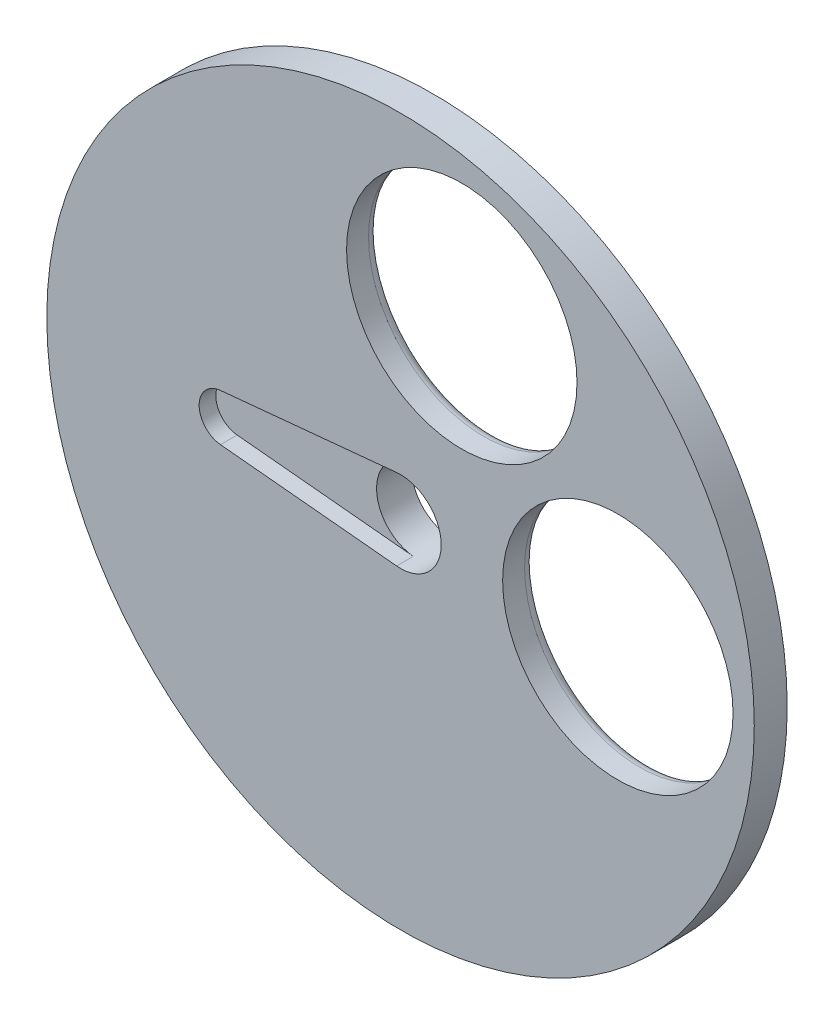
ISO-10303-21;
HEADER;
FILE_DESCRIPTION(('STEP AP214'),'2;1');
FILE_NAME('part.step','',(''),(''),'','','');
FILE_SCHEMA(('AUTOMOTIVE_DESIGN { 1 0 10303 214 1 1 1 1 }'));
ENDSEC;
DATA;
#1=APPLICATION_CONTEXT('core data for automotive mechanical design processes');
#2=APPLICATION_PROTOCOL_DEFINITION('international standard','automotive_design',2000,#1);
#3=PRODUCT_CONTEXT('',#1,'mechanical');
#4=PRODUCT('Part','Part','',(#3));
#5=PRODUCT_RELATED_PRODUCT_CATEGORY('part','',(#4));
#6=PRODUCT_DEFINITION_FORMATION('','',#4);
#7=PRODUCT_DEFINITION_CONTEXT('part definition',#1,'design');
#8=PRODUCT_DEFINITION('design','',#6,#7);
#9=PRODUCT_DEFINITION_SHAPE('','',#8);
#10=(LENGTH_UNIT() NAMED_UNIT(*) SI_UNIT(.MILLI.,.METRE.));
#11=(NAMED_UNIT(*) PLANE_ANGLE_UNIT() SI_UNIT($,.RADIAN.));
#12=(NAMED_UNIT(*) SI_UNIT($,.STERADIAN.) SOLID_ANGLE_UNIT());
#13=UNCERTAINTY_MEASURE_WITH_UNIT(LENGTH_MEASURE(1.E-05),#10,'distance_accuracy_value','');
#14=(GEOMETRIC_REPRESENTATION_CONTEXT(3) GLOBAL_UNCERTAINTY_ASSIGNED_CONTEXT((#13)) GLOBAL_UNIT_ASSIGNED_CONTEXT((#10,
#11,#12)) REPRESENTATION_CONTEXT('',''));
#15=CARTESIAN_POINT('',(0.,0.,0.));
#16=DIRECTION('',(0.,0.,1.));
#17=DIRECTION('',(1.,0.,0.));
#18=AXIS2_PLACEMENT_3D('',#15,#16,#17);
#19=CARTESIAN_POINT('',(0.,0.,-3.));
#20=DIRECTION('',(0.,0.,1.));
#21=DIRECTION('',(1.,0.,0.));
#22=AXIS2_PLACEMENT_3D('',#19,#20,#21);
#23=PLANE('',#22);
#24=CARTESIAN_POINT('',(0.,0.,-3.));
#25=DIRECTION('',(0.,0.,1.));
#26=DIRECTION('',(1.,0.,0.));
#27=AXIS2_PLACEMENT_3D('',#24,#25,#26);
#28=CIRCLE('',#27,32.2367010240624);
#29=CARTESIAN_POINT('',(32.2367010240624,0.,-3.));
#30=VERTEX_POINT('',#29);
#31=EDGE_CURVE('E90',#30,#30,#28,.T.);
#32=ORIENTED_EDGE('',*,*,#31,.F.);
#33=EDGE_LOOP('',(#32));
#34=FACE_BOUND('',#33,.T.);
#35=CARTESIAN_POINT('',(5.58185678955525,18.9999999999999,-3.));
#36=DIRECTION('',(0.,0.,1.));
#37=DIRECTION('',(1.,0.,0.));
#38=AXIS2_PLACEMENT_3D('',#35,#36,#37);
#39=CIRCLE('',#38,11.5);
#40=CARTESIAN_POINT('',(17.0818567895552,18.9999999999999,-3.));
#41=VERTEX_POINT('',#40);
#42=EDGE_CURVE('E113',#41,#41,#39,.T.);
#43=ORIENTED_EDGE('',*,*,#42,.T.);
#44=EDGE_LOOP('',(#43));
#45=FACE_BOUND('',#44,.T.);
#46=CARTESIAN_POINT('',(19.8029574866761,0.,-3.));
#47=DIRECTION('',(0.,0.,1.));
#48=DIRECTION('',(1.,0.,0.));
#49=AXIS2_PLACEMENT_3D('',#46,#47,#48);
#50=CIRCLE('',#49,11.5);
#51=CARTESIAN_POINT('',(31.3029574866761,0.,-3.));
#52=VERTEX_POINT('',#51);
#53=EDGE_CURVE('E214',#52,#52,#50,.T.);
#54=ORIENTED_EDGE('',*,*,#53,.T.);
#55=EDGE_LOOP('',(#54));
#56=FACE_BOUND('',#55,.T.);
#57=CARTESIAN_POINT('',(0.,0.,-3.));
#58=DIRECTION('',(0.,0.,1.));
#59=DIRECTION('',(1.,0.,0.));
#60=AXIS2_PLACEMENT_3D('',#57,#58,#59);
#61=CIRCLE('',#60,5.705);
#62=CARTESIAN_POINT('',(5.705,0.,-3.));
#63=VERTEX_POINT('',#62);
#64=EDGE_CURVE('E13',#63,#63,#61,.F.);
#65=ORIENTED_EDGE('',*,*,#64,.F.);
#66=EDGE_LOOP('',(#65));
#67=FACE_BOUND('',#66,.T.);
#68=ADVANCED_FACE('F42',(#34,#45,#56,#67),#23,.F.);
#69=CARTESIAN_POINT('',(0.,0.,-92.6991595887913));
#70=DIRECTION('',(0.,0.,1.));
#71=DIRECTION('',(1.,0.,0.));
#72=AXIS2_PLACEMENT_3D('',#69,#70,#71);
#73=CYLINDRICAL_SURFACE('',#72,32.2367010240624);
#74=CARTESIAN_POINT('',(0.,0.,0.));
#75=DIRECTION('',(0.,0.,1.));
#76=DIRECTION('',(1.,0.,0.));
#77=AXIS2_PLACEMENT_3D('',#74,#75,#76);
#78=CIRCLE('',#77,32.2367010240624);
#79=CARTESIAN_POINT('',(32.2367010240624,0.,0.));
#80=VERTEX_POINT('',#79);
#81=EDGE_CURVE('E103',#80,#80,#78,.T.);
#82=ORIENTED_EDGE('',*,*,#81,.F.);
#83=EDGE_LOOP('',(#82));
#84=FACE_BOUND('',#83,.T.);
#85=ORIENTED_EDGE('',*,*,#31,.T.);
#86=EDGE_LOOP('',(#85));
#87=FACE_BOUND('',#86,.T.);
#88=ADVANCED_FACE('F147',(#84,#87),#73,.T.);
#89=CARTESIAN_POINT('',(5.58185678955525,18.9999999999999,-92.6991595887913));
#90=DIRECTION('',(0.,0.,1.));
#91=DIRECTION('',(1.,0.,0.));
#92=AXIS2_PLACEMENT_3D('',#89,#90,#91);
#93=CYLINDRICAL_SURFACE('',#92,10.5);
#94=CARTESIAN_POINT('',(5.58185678955525,18.9999999999999,-2.));
#95=DIRECTION('',(0.,0.,1.));
#96=DIRECTION('',(1.,0.,0.));
#97=AXIS2_PLACEMENT_3D('',#94,#95,#96);
#98=CIRCLE('',#97,10.5);
#99=CARTESIAN_POINT('',(16.0818567895552,18.9999999999999,-2.));
#100=VERTEX_POINT('',#99);
#101=EDGE_CURVE('E50',#100,#100,#98,.F.);
#102=ORIENTED_EDGE('',*,*,#101,.T.);
#103=EDGE_LOOP('',(#102));
#104=FACE_BOUND('',#103,.T.);
#105=CARTESIAN_POINT('',(5.58185678955525,18.9999999999999,0.));
#106=DIRECTION('',(0.,0.,1.));
#107=DIRECTION('',(1.,0.,0.));
#108=AXIS2_PLACEMENT_3D('',#105,#106,#107);
#109=CIRCLE('',#108,10.5);
#110=CARTESIAN_POINT('',(16.0818567895552,18.9999999999999,0.));
#111=VERTEX_POINT('',#110);
#112=EDGE_CURVE('E107',#111,#111,#109,.T.);
#113=ORIENTED_EDGE('',*,*,#112,.T.);
#114=EDGE_LOOP('',(#113));
#115=FACE_BOUND('',#114,.T.);
#116=ADVANCED_FACE('F137',(#104,#115),#93,.F.);
#117=CARTESIAN_POINT('',(19.8029574866761,0.,-92.6991595887913));
#118=DIRECTION('',(0.,0.,1.));
#119=DIRECTION('',(1.,0.,0.));
#120=AXIS2_PLACEMENT_3D('',#117,#118,#119);
#121=CYLINDRICAL_SURFACE('',#120,10.5);
#122=CARTESIAN_POINT('',(19.8029574866761,0.,-2.));
#123=DIRECTION('',(0.,0.,1.));
#124=DIRECTION('',(1.,0.,0.));
#125=AXIS2_PLACEMENT_3D('',#122,#123,#124);
#126=CIRCLE('',#125,10.5);
#127=CARTESIAN_POINT('',(30.3029574866761,0.,-2.));
#128=VERTEX_POINT('',#127);
#129=EDGE_CURVE('E211',#128,#128,#126,.F.);
#130=ORIENTED_EDGE('',*,*,#129,.T.);
#131=EDGE_LOOP('',(#130));
#132=FACE_BOUND('',#131,.T.);
#133=CARTESIAN_POINT('',(19.8029574866761,0.,0.));
#134=DIRECTION('',(0.,0.,1.));
#135=DIRECTION('',(1.,0.,0.));
#136=AXIS2_PLACEMENT_3D('',#133,#134,#135);
#137=CIRCLE('',#136,10.5);
#138=CARTESIAN_POINT('',(30.3029574866761,0.,0.));
#139=VERTEX_POINT('',#138);
#140=EDGE_CURVE('E122',#139,#139,#137,.T.);
#141=ORIENTED_EDGE('',*,*,#140,.T.);
#142=EDGE_LOOP('',(#141));
#143=FACE_BOUND('',#142,.T.);
#144=ADVANCED_FACE('F142',(#132,#143),#121,.F.);
#145=CARTESIAN_POINT('',(0.,0.,0.));
#146=DIRECTION('',(0.,0.,1.));
#147=DIRECTION('',(1.,0.,0.));
#148=AXIS2_PLACEMENT_3D('',#145,#146,#147);
#149=PLANE('',#148);
#150=CARTESIAN_POINT('',(0.,0.,0.));
#151=DIRECTION('',(0.,0.,1.));
#152=DIRECTION('',(1.,0.,0.));
#153=AXIS2_PLACEMENT_3D('',#150,#151,#152);
#154=CIRCLE('',#153,3.705);
#155=CARTESIAN_POINT('',(-0.355524529466215,-3.68790283344719,0.));
#156=VERTEX_POINT('',#155);
#157=CARTESIAN_POINT('',(-0.355524529466215,3.68790283344719,0.));
#158=VERTEX_POINT('',#157);
#159=EDGE_CURVE('E96',#156,#158,#154,.T.);
#160=ORIENTED_EDGE('',*,*,#159,.F.);
#161=DIRECTION('',(0.99538538014769,-0.095958037642703,0.));
#162=VECTOR('',#161,1.);
#163=CARTESIAN_POINT('',(-16.4113097809318,-2.14007856731753,0.));
#164=LINE('',#163,#162);
#165=CARTESIAN_POINT('',(-16.4113097809318,-2.14007856731753,0.));
#166=VERTEX_POINT('',#165);
#167=EDGE_CURVE('E99',#166,#156,#164,.T.);
#168=ORIENTED_EDGE('',*,*,#167,.F.);
#169=CARTESIAN_POINT('',(-16.205,0.,0.));
#170=DIRECTION('',(0.,0.,1.));
#171=DIRECTION('',(1.,0.,0.));
#172=AXIS2_PLACEMENT_3D('',#169,#170,#171);
#173=CIRCLE('',#172,2.15);
#174=CARTESIAN_POINT('',(-16.4113097809318,2.14007856731753,0.));
#175=VERTEX_POINT('',#174);
#176=EDGE_CURVE('E163',#175,#166,#173,.T.);
#177=ORIENTED_EDGE('',*,*,#176,.F.);
#178=DIRECTION('',(-0.99538538014769,-0.095958037642703,0.));
#179=VECTOR('',#178,1.);
#180=CARTESIAN_POINT('',(-0.355524529466215,3.68790283344719,0.));
#181=LINE('',#180,#179);
#182=EDGE_CURVE('E155',#158,#175,#181,.T.);
#183=ORIENTED_EDGE('',*,*,#182,.F.);
#184=EDGE_LOOP('',(#160,#168,#177,#183));
#185=FACE_BOUND('',#184,.T.);
#186=ORIENTED_EDGE('',*,*,#140,.F.);
#187=EDGE_LOOP('',(#186));
#188=FACE_BOUND('',#187,.T.);
#189=ORIENTED_EDGE('',*,*,#112,.F.);
#190=EDGE_LOOP('',(#189));
#191=FACE_BOUND('',#190,.T.);
#192=ORIENTED_EDGE('',*,*,#81,.T.);
#193=EDGE_LOOP('',(#192));
#194=FACE_BOUND('',#193,.T.);
#195=ADVANCED_FACE('F139',(#185,#188,#191,#194),#149,.T.);
#196=CARTESIAN_POINT('',(-0.355524529466215,3.68790283344719,-92.6991595887913));
#197=DIRECTION('',(-0.095958037642703,0.99538538014769,0.));
#198=DIRECTION('',(-0.99538538014769,-0.095958037642703,0.));
#199=AXIS2_PLACEMENT_3D('',#196,#197,#198);
#200=PLANE('',#199);
#201=DIRECTION('',(0.,0.,1.));
#202=VECTOR('',#201,1.);
#203=CARTESIAN_POINT('',(-16.4113097809318,2.14007856731753,-92.6991595887913));
#204=LINE('',#203,#202);
#205=CARTESIAN_POINT('',(-16.4113097809318,2.14007856731753,-1.51999999999999));
#206=VERTEX_POINT('',#205);
#207=EDGE_CURVE('E98',#206,#175,#204,.T.);
#208=ORIENTED_EDGE('',*,*,#207,.F.);
#209=DIRECTION('',(0.99538538014769,0.095958037642703,0.));
#210=VECTOR('',#209,1.);
#211=CARTESIAN_POINT('',(-0.355524529466215,3.68790283344719,-1.51999999999999));
#212=LINE('',#211,#210);
#213=CARTESIAN_POINT('',(-0.355524529466215,3.68790283344719,-1.52));
#214=VERTEX_POINT('',#213);
#215=EDGE_CURVE('E85',#206,#214,#212,.T.);
#216=ORIENTED_EDGE('',*,*,#215,.T.);
#217=DIRECTION('',(0.,0.,1.));
#218=VECTOR('',#217,1.);
#219=CARTESIAN_POINT('',(-0.355524529466215,3.68790283344719,-92.6991595887913));
#220=LINE('',#219,#218);
#221=EDGE_CURVE('E65',#214,#158,#220,.T.);
#222=ORIENTED_EDGE('',*,*,#221,.T.);
#223=ORIENTED_EDGE('',*,*,#182,.T.);
#224=EDGE_LOOP('',(#208,#216,#222,#223));
#225=FACE_BOUND('',#224,.T.);
#226=ADVANCED_FACE('F102',(#225),#200,.F.);
#227=CARTESIAN_POINT('',(-16.205,0.,-92.6991595887913));
#228=DIRECTION('',(0.,0.,1.));
#229=DIRECTION('',(1.,0.,0.));
#230=AXIS2_PLACEMENT_3D('',#227,#228,#229);
#231=CYLINDRICAL_SURFACE('',#230,2.15);
#232=DIRECTION('',(0.,0.,1.));
#233=VECTOR('',#232,1.);
#234=CARTESIAN_POINT('',(-16.4113097809318,-2.14007856731753,-92.6991595887913));
#235=LINE('',#234,#233);
#236=CARTESIAN_POINT('',(-16.4113097809318,-2.14007856731753,-1.51999999999999));
#237=VERTEX_POINT('',#236);
#238=EDGE_CURVE('E123',#237,#166,#235,.T.);
#239=ORIENTED_EDGE('',*,*,#238,.F.);
#240=CARTESIAN_POINT('',(-16.205,0.,-1.51999999999999));
#241=DIRECTION('',(0.,0.,1.));
#242=DIRECTION('',(1.,0.,0.));
#243=AXIS2_PLACEMENT_3D('',#240,#241,#242);
#244=CIRCLE('',#243,2.15);
#245=EDGE_CURVE('E57',#237,#206,#244,.F.);
#246=ORIENTED_EDGE('',*,*,#245,.T.);
#247=ORIENTED_EDGE('',*,*,#207,.T.);
#248=ORIENTED_EDGE('',*,*,#176,.T.);
#249=EDGE_LOOP('',(#239,#246,#247,#248));
#250=FACE_BOUND('',#249,.T.);
#251=ADVANCED_FACE('F191',(#250),#231,.F.);
#252=CARTESIAN_POINT('',(-16.4113097809318,-2.14007856731753,-92.6991595887913));
#253=DIRECTION('',(-0.095958037642703,-0.99538538014769,0.));
#254=DIRECTION('',(0.99538538014769,-0.095958037642703,0.));
#255=AXIS2_PLACEMENT_3D('',#252,#253,#254);
#256=PLANE('',#255);
#257=DIRECTION('',(0.,0.,1.));
#258=VECTOR('',#257,1.);
#259=CARTESIAN_POINT('',(-0.355524529466215,-3.68790283344719,-92.6991595887913));
#260=LINE('',#259,#258);
#261=CARTESIAN_POINT('',(-0.355524529466215,-3.68790283344719,-1.52));
#262=VERTEX_POINT('',#261);
#263=EDGE_CURVE('E120',#262,#156,#260,.T.);
#264=ORIENTED_EDGE('',*,*,#263,.F.);
#265=DIRECTION('',(-0.99538538014769,0.095958037642703,0.));
#266=VECTOR('',#265,1.);
#267=CARTESIAN_POINT('',(-16.4113097809318,-2.14007856731753,-1.51999999999999));
#268=LINE('',#267,#266);
#269=EDGE_CURVE('E87',#262,#237,#268,.T.);
#270=ORIENTED_EDGE('',*,*,#269,.T.);
#271=ORIENTED_EDGE('',*,*,#238,.T.);
#272=ORIENTED_EDGE('',*,*,#167,.T.);
#273=EDGE_LOOP('',(#264,#270,#271,#272));
#274=FACE_BOUND('',#273,.T.);
#275=ADVANCED_FACE('F167',(#274),#256,.F.);
#276=CARTESIAN_POINT('',(0.,0.,-92.6991595887913));
#277=DIRECTION('',(0.,0.,1.));
#278=DIRECTION('',(1.,0.,0.));
#279=AXIS2_PLACEMENT_3D('',#276,#277,#278);
#280=CYLINDRICAL_SURFACE('',#279,3.705);
#281=ORIENTED_EDGE('',*,*,#221,.F.);
#282=CARTESIAN_POINT('',(0.,0.,-1.52));
#283=DIRECTION('',(0.,0.,-1.));
#284=DIRECTION('',(-1.,0.,0.));
#285=AXIS2_PLACEMENT_3D('',#282,#283,#284);
#286=CIRCLE('',#285,3.705);
#287=EDGE_CURVE('E83',#262,#214,#286,.T.);
#288=ORIENTED_EDGE('',*,*,#287,.F.);
#289=ORIENTED_EDGE('',*,*,#263,.T.);
#290=ORIENTED_EDGE('',*,*,#159,.T.);
#291=EDGE_LOOP('',(#281,#288,#289,#290));
#292=FACE_BOUND('',#291,.T.);
#293=CARTESIAN_POINT('',(0.,0.,-4.69999999999995));
#294=DIRECTION('',(0.,0.,1.));
#295=DIRECTION('',(1.,0.,0.));
#296=AXIS2_PLACEMENT_3D('',#293,#294,#295);
#297=CIRCLE('',#296,3.705);
#298=CARTESIAN_POINT('',(3.705,0.,-4.69999999999995));
#299=VERTEX_POINT('',#298);
#300=EDGE_CURVE('E91',#299,#299,#297,.T.);
#301=ORIENTED_EDGE('',*,*,#300,.F.);
#302=EDGE_LOOP('',(#301));
#303=FACE_BOUND('',#302,.T.);
#304=ADVANCED_FACE('F93',(#292,#303),#280,.F.);
#305=CARTESIAN_POINT('',(0.,0.,-1.52));
#306=DIRECTION('',(0.,0.,-1.));
#307=DIRECTION('',(-1.,0.,0.));
#308=AXIS2_PLACEMENT_3D('',#305,#306,#307);
#309=PLANE('',#308);
#310=ORIENTED_EDGE('',*,*,#215,.F.);
#311=ORIENTED_EDGE('',*,*,#245,.F.);
#312=ORIENTED_EDGE('',*,*,#269,.F.);
#313=ORIENTED_EDGE('',*,*,#287,.T.);
#314=EDGE_LOOP('',(#310,#311,#312,#313));
#315=FACE_BOUND('',#314,.T.);
#316=ADVANCED_FACE('F84',(#315),#309,.F.);
#317=CARTESIAN_POINT('',(19.8029574866761,0.,-2.));
#318=DIRECTION('',(0.,0.,1.));
#319=DIRECTION('',(1.,0.,0.));
#320=AXIS2_PLACEMENT_3D('',#317,#318,#319);
#321=TOROIDAL_SURFACE('',#320,11.5,1.);
#322=ORIENTED_EDGE('',*,*,#129,.F.);
#323=EDGE_LOOP('',(#322));
#324=FACE_BOUND('',#323,.T.);
#325=ORIENTED_EDGE('',*,*,#53,.F.);
#326=EDGE_LOOP('',(#325));
#327=FACE_BOUND('',#326,.T.);
#328=ADVANCED_FACE('F199',(#324,#327),#321,.T.);
#329=CARTESIAN_POINT('',(5.58185678955525,18.9999999999999,-2.));
#330=DIRECTION('',(0.,0.,1.));
#331=DIRECTION('',(1.,0.,0.));
#332=AXIS2_PLACEMENT_3D('',#329,#330,#331);
#333=TOROIDAL_SURFACE('',#332,11.5,1.);
#334=ORIENTED_EDGE('',*,*,#101,.F.);
#335=EDGE_LOOP('',(#334));
#336=FACE_BOUND('',#335,.T.);
#337=ORIENTED_EDGE('',*,*,#42,.F.);
#338=EDGE_LOOP('',(#337));
#339=FACE_BOUND('',#338,.T.);
#340=ADVANCED_FACE('F44',(#336,#339),#333,.T.);
#341=CARTESIAN_POINT('',(0.,0.,-20.836176746677));
#342=DIRECTION('',(0.,0.,1.));
#343=DIRECTION('',(1.,0.,0.));
#344=AXIS2_PLACEMENT_3D('',#341,#342,#343);
#345=CYLINDRICAL_SURFACE('',#344,5.705);
#346=CARTESIAN_POINT('',(0.,0.,-4.69999999999995));
#347=DIRECTION('',(0.,0.,1.));
#348=DIRECTION('',(1.,0.,0.));
#349=AXIS2_PLACEMENT_3D('',#346,#347,#348);
#350=CIRCLE('',#349,5.705);
#351=CARTESIAN_POINT('',(5.705,0.,-4.69999999999995));
#352=VERTEX_POINT('',#351);
#353=EDGE_CURVE('E235',#352,#352,#350,.T.);
#354=ORIENTED_EDGE('',*,*,#353,.T.);
#355=EDGE_LOOP('',(#354));
#356=FACE_BOUND('',#355,.T.);
#357=ORIENTED_EDGE('',*,*,#64,.T.);
#358=EDGE_LOOP('',(#357));
#359=FACE_BOUND('',#358,.T.);
#360=ADVANCED_FACE('F207',(#356,#359),#345,.T.);
#361=CARTESIAN_POINT('',(0.,0.,-4.69999999999995));
#362=DIRECTION('',(0.,0.,1.));
#363=DIRECTION('',(0.,-1.,0.));
#364=AXIS2_PLACEMENT_3D('',#361,#362,#363);
#365=PLANE('',#364);
#366=ORIENTED_EDGE('',*,*,#300,.T.);
#367=EDGE_LOOP('',(#366));
#368=FACE_BOUND('',#367,.T.);
#369=ORIENTED_EDGE('',*,*,#353,.F.);
#370=EDGE_LOOP('',(#369));
#371=FACE_BOUND('',#370,.T.);
#372=ADVANCED_FACE('F226',(#368,#371),#365,.F.);
#373=CLOSED_SHELL('',(#68,#88,#116,#144,#195,#226,#251,#275,#304,#316,#328,#340,#360,#372));
#374=MANIFOLD_SOLID_BREP('B2',#373);
#375=ADVANCED_BREP_SHAPE_REPRESENTATION('',(#18,#374),#14);
#376=SHAPE_DEFINITION_REPRESENTATION(#9,#375);
ENDSEC;
END-ISO-10303-21;
